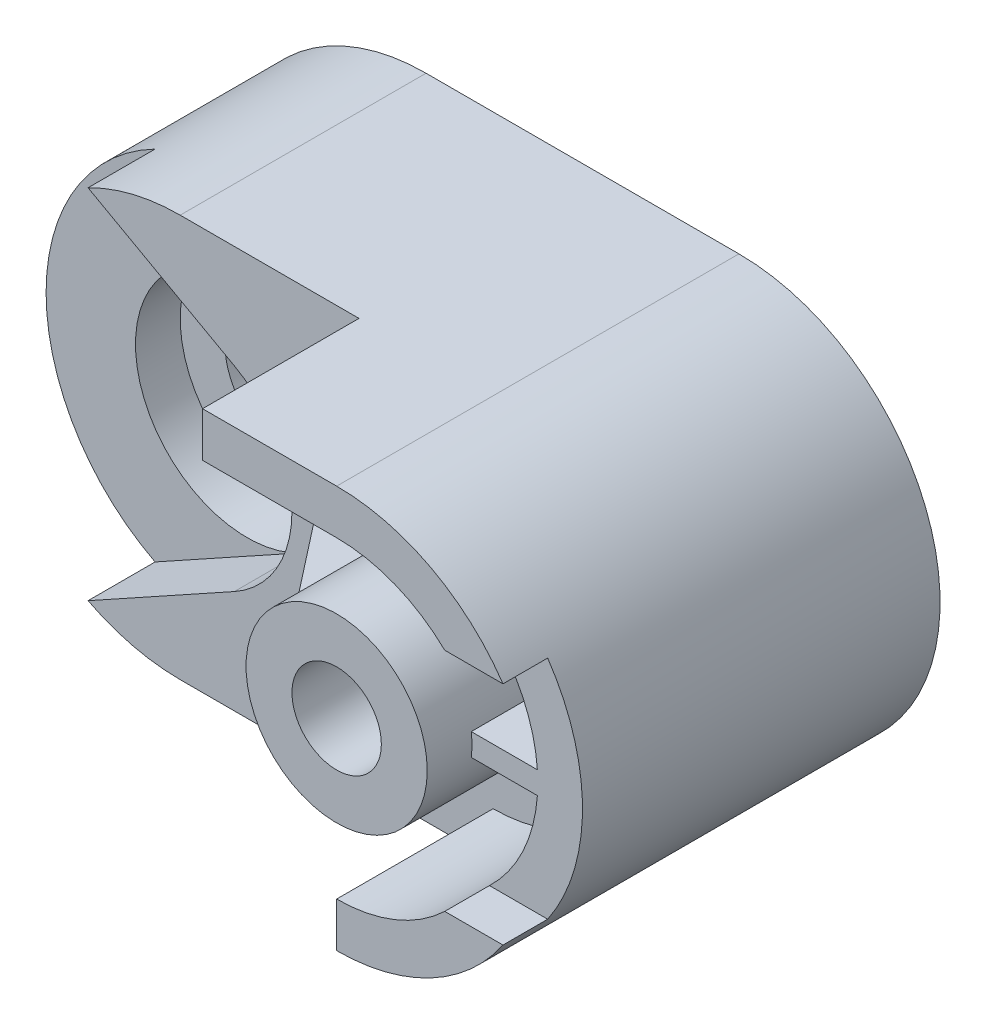
ISO-10303-21;
HEADER;
FILE_DESCRIPTION(('STEP AP214'),'2;1');
FILE_NAME('part.step','',(''),(''),'','','');
FILE_SCHEMA(('AUTOMOTIVE_DESIGN { 1 0 10303 214 1 1 1 1 }'));
ENDSEC;
DATA;
#1=APPLICATION_CONTEXT('core data for automotive mechanical design processes');
#2=APPLICATION_PROTOCOL_DEFINITION('international standard','automotive_design',2000,#1);
#3=PRODUCT_CONTEXT('',#1,'mechanical');
#4=PRODUCT('Part','Part','',(#3));
#5=PRODUCT_RELATED_PRODUCT_CATEGORY('part','',(#4));
#6=PRODUCT_DEFINITION_FORMATION('','',#4);
#7=PRODUCT_DEFINITION_CONTEXT('part definition',#1,'design');
#8=PRODUCT_DEFINITION('design','',#6,#7);
#9=PRODUCT_DEFINITION_SHAPE('','',#8);
#10=(LENGTH_UNIT() NAMED_UNIT(*) SI_UNIT(.MILLI.,.METRE.));
#11=(NAMED_UNIT(*) PLANE_ANGLE_UNIT() SI_UNIT($,.RADIAN.));
#12=(NAMED_UNIT(*) SI_UNIT($,.STERADIAN.) SOLID_ANGLE_UNIT());
#13=UNCERTAINTY_MEASURE_WITH_UNIT(LENGTH_MEASURE(1.E-05),#10,'distance_accuracy_value','');
#14=(GEOMETRIC_REPRESENTATION_CONTEXT(3) GLOBAL_UNCERTAINTY_ASSIGNED_CONTEXT((#13)) GLOBAL_UNIT_ASSIGNED_CONTEXT((#10,
#11,#12)) REPRESENTATION_CONTEXT('',''));
#15=CARTESIAN_POINT('',(0.,0.,0.));
#16=DIRECTION('',(0.,0.,1.));
#17=DIRECTION('',(1.,0.,0.));
#18=AXIS2_PLACEMENT_3D('',#15,#16,#17);
#19=CARTESIAN_POINT('',(145.,25.3,80.));
#20=DIRECTION('',(0.,0.,1.));
#21=DIRECTION('',(1.,0.,0.));
#22=AXIS2_PLACEMENT_3D('',#19,#20,#21);
#23=PLANE('',#22);
#24=CARTESIAN_POINT('',(70.,0.,80.));
#25=DIRECTION('',(0.,0.,1.));
#26=DIRECTION('',(1.,0.,0.));
#27=AXIS2_PLACEMENT_3D('',#24,#25,#26);
#28=CIRCLE('',#27,35.);
#29=CARTESIAN_POINT('',(104.910600109422,2.50000000000001,80.));
#30=VERTEX_POINT('',#29);
#31=CARTESIAN_POINT('',(94.1849126523128,25.3,80.));
#32=VERTEX_POINT('',#31);
#33=EDGE_CURVE('E417',#30,#32,#28,.T.);
#34=ORIENTED_EDGE('',*,*,#33,.F.);
#35=DIRECTION('',(1.,0.,0.));
#36=VECTOR('',#35,1.);
#37=CARTESIAN_POINT('',(0.,2.50000000000001,80.));
#38=LINE('',#37,#36);
#39=CARTESIAN_POINT('',(90.1126705203132,2.50000000000001,80.));
#40=VERTEX_POINT('',#39);
#41=EDGE_CURVE('E451',#40,#30,#38,.T.);
#42=ORIENTED_EDGE('',*,*,#41,.F.);
#43=CARTESIAN_POINT('',(70.,0.,80.));
#44=DIRECTION('',(0.,0.,1.));
#45=DIRECTION('',(1.,0.,0.));
#46=AXIS2_PLACEMENT_3D('',#43,#44,#45);
#47=CIRCLE('',#46,20.2674496535374);
#48=CARTESIAN_POINT('',(90.1126705203132,-2.49999999999999,80.));
#49=VERTEX_POINT('',#48);
#50=EDGE_CURVE('E224',#40,#49,#47,.F.);
#51=ORIENTED_EDGE('',*,*,#50,.T.);
#52=DIRECTION('',(1.,0.,0.));
#53=VECTOR('',#52,1.);
#54=CARTESIAN_POINT('',(0.,-2.49999999999999,80.));
#55=LINE('',#54,#53);
#56=CARTESIAN_POINT('',(104.910600109422,-2.49999999999999,80.));
#57=VERTEX_POINT('',#56);
#58=EDGE_CURVE('E440',#49,#57,#55,.T.);
#59=ORIENTED_EDGE('',*,*,#58,.T.);
#60=CARTESIAN_POINT('',(70.,0.,80.));
#61=DIRECTION('',(0.,0.,1.));
#62=DIRECTION('',(1.,0.,0.));
#63=AXIS2_PLACEMENT_3D('',#60,#61,#62);
#64=CIRCLE('',#63,35.);
#65=CARTESIAN_POINT('',(94.1849126523128,-25.3,80.));
#66=VERTEX_POINT('',#65);
#67=EDGE_CURVE('E420',#57,#66,#64,.F.);
#68=ORIENTED_EDGE('',*,*,#67,.T.);
#69=DIRECTION('',(-1.,0.,0.));
#70=VECTOR('',#69,1.);
#71=CARTESIAN_POINT('',(145.,-25.3,80.));
#72=LINE('',#71,#70);
#73=CARTESIAN_POINT('',(107.214378941479,-25.3,80.));
#74=VERTEX_POINT('',#73);
#75=EDGE_CURVE('E223',#74,#66,#72,.T.);
#76=ORIENTED_EDGE('',*,*,#75,.F.);
#77=CARTESIAN_POINT('',(70.,0.,80.));
#78=DIRECTION('',(0.,0.,1.));
#79=DIRECTION('',(1.,0.,0.));
#80=AXIS2_PLACEMENT_3D('',#77,#78,#79);
#81=CIRCLE('',#80,45.);
#82=CARTESIAN_POINT('',(107.214378941479,25.3,80.));
#83=VERTEX_POINT('',#82);
#84=EDGE_CURVE('E261',#74,#83,#81,.T.);
#85=ORIENTED_EDGE('',*,*,#84,.T.);
#86=DIRECTION('',(-1.,0.,0.));
#87=VECTOR('',#86,1.);
#88=CARTESIAN_POINT('',(145.,25.3,80.));
#89=LINE('',#88,#87);
#90=EDGE_CURVE('E256',#83,#32,#89,.T.);
#91=ORIENTED_EDGE('',*,*,#90,.T.);
#92=EDGE_LOOP('',(#34,#42,#51,#59,#68,#76,#85,#91));
#93=FACE_BOUND('',#92,.T.);
#94=ADVANCED_FACE('F33',(#93),#23,.T.);
#95=CARTESIAN_POINT('',(70.,0.,90.));
#96=DIRECTION('',(0.,0.,-1.));
#97=DIRECTION('',(-1.,0.,0.));
#98=AXIS2_PLACEMENT_3D('',#95,#96,#97);
#99=CYLINDRICAL_SURFACE('',#98,45.);
#100=ORIENTED_EDGE('',*,*,#84,.F.);
#101=DIRECTION('',(0.,0.,-1.));
#102=VECTOR('',#101,1.);
#103=CARTESIAN_POINT('',(107.214378941479,-25.3,90.));
#104=LINE('',#103,#102);
#105=CARTESIAN_POINT('',(107.214378941479,-25.3,90.));
#106=VERTEX_POINT('',#105);
#107=EDGE_CURVE('E252',#106,#74,#104,.T.);
#108=ORIENTED_EDGE('',*,*,#107,.F.);
#109=CARTESIAN_POINT('',(70.,0.,90.));
#110=DIRECTION('',(0.,0.,1.));
#111=DIRECTION('',(1.,0.,0.));
#112=AXIS2_PLACEMENT_3D('',#109,#110,#111);
#113=CIRCLE('',#112,45.);
#114=CARTESIAN_POINT('',(70.,-45.,90.));
#115=VERTEX_POINT('',#114);
#116=EDGE_CURVE('E385',#115,#106,#113,.T.);
#117=ORIENTED_EDGE('',*,*,#116,.F.);
#118=DIRECTION('',(0.,0.,-1.));
#119=VECTOR('',#118,1.);
#120=CARTESIAN_POINT('',(70.,-45.,90.));
#121=LINE('',#120,#119);
#122=CARTESIAN_POINT('',(70.,-45.,55.));
#123=VERTEX_POINT('',#122);
#124=EDGE_CURVE('E408',#115,#123,#121,.T.);
#125=ORIENTED_EDGE('',*,*,#124,.T.);
#126=CARTESIAN_POINT('',(70.,-45.,0.));
#127=VERTEX_POINT('',#126);
#128=EDGE_CURVE('E407',#123,#127,#121,.T.);
#129=ORIENTED_EDGE('',*,*,#128,.T.);
#130=CARTESIAN_POINT('',(70.,0.,0.));
#131=DIRECTION('',(0.,0.,1.));
#132=DIRECTION('',(1.,0.,0.));
#133=AXIS2_PLACEMENT_3D('',#130,#131,#132);
#134=CIRCLE('',#133,45.);
#135=CARTESIAN_POINT('',(70.,45.,0.));
#136=VERTEX_POINT('',#135);
#137=EDGE_CURVE('E398',#127,#136,#134,.T.);
#138=ORIENTED_EDGE('',*,*,#137,.T.);
#139=DIRECTION('',(0.,0.,-1.));
#140=VECTOR('',#139,1.);
#141=CARTESIAN_POINT('',(70.,45.,90.));
#142=LINE('',#141,#140);
#143=CARTESIAN_POINT('',(70.,45.,90.));
#144=VERTEX_POINT('',#143);
#145=EDGE_CURVE('E404',#144,#136,#142,.T.);
#146=ORIENTED_EDGE('',*,*,#145,.F.);
#147=CARTESIAN_POINT('',(107.214378941479,25.3,90.));
#148=VERTEX_POINT('',#147);
#149=EDGE_CURVE('E389',#148,#144,#113,.T.);
#150=ORIENTED_EDGE('',*,*,#149,.F.);
#151=DIRECTION('',(0.,0.,-1.));
#152=VECTOR('',#151,1.);
#153=CARTESIAN_POINT('',(107.214378941479,25.3,90.));
#154=LINE('',#153,#152);
#155=EDGE_CURVE('E259',#83,#148,#154,.F.);
#156=ORIENTED_EDGE('',*,*,#155,.F.);
#157=EDGE_LOOP('',(#100,#108,#117,#125,#129,#138,#146,#150,#156));
#158=FACE_BOUND('',#157,.T.);
#159=ADVANCED_FACE('F506',(#158),#99,.T.);
#160=CARTESIAN_POINT('',(70.,0.,55.));
#161=DIRECTION('',(0.,0.,1.));
#162=DIRECTION('',(1.,0.,0.));
#163=AXIS2_PLACEMENT_3D('',#160,#161,#162);
#164=CYLINDRICAL_SURFACE('',#163,35.);
#165=ORIENTED_EDGE('',*,*,#67,.F.);
#166=DIRECTION('',(0.,0.,1.));
#167=VECTOR('',#166,1.);
#168=CARTESIAN_POINT('',(104.910600109422,-2.49999999999999,55.));
#169=LINE('',#168,#167);
#170=CARTESIAN_POINT('',(104.910600109422,-2.49999999999999,55.));
#171=VERTEX_POINT('',#170);
#172=EDGE_CURVE('E434',#171,#57,#169,.T.);
#173=ORIENTED_EDGE('',*,*,#172,.F.);
#174=CARTESIAN_POINT('',(70.,0.,55.));
#175=DIRECTION('',(0.,0.,1.));
#176=DIRECTION('',(1.,0.,0.));
#177=AXIS2_PLACEMENT_3D('',#174,#175,#176);
#178=CIRCLE('',#177,35.);
#179=CARTESIAN_POINT('',(70.,-35.,55.));
#180=VERTEX_POINT('',#179);
#181=EDGE_CURVE('E289',#180,#171,#178,.T.);
#182=ORIENTED_EDGE('',*,*,#181,.F.);
#183=DIRECTION('',(0.,0.,1.));
#184=VECTOR('',#183,1.);
#185=CARTESIAN_POINT('',(70.,-35.,55.));
#186=LINE('',#185,#184);
#187=CARTESIAN_POINT('',(70.,-35.,90.));
#188=VERTEX_POINT('',#187);
#189=EDGE_CURVE('E309',#180,#188,#186,.T.);
#190=ORIENTED_EDGE('',*,*,#189,.T.);
#191=CARTESIAN_POINT('',(70.,0.,90.));
#192=DIRECTION('',(0.,0.,1.));
#193=DIRECTION('',(1.,0.,0.));
#194=AXIS2_PLACEMENT_3D('',#191,#192,#193);
#195=CIRCLE('',#194,35.);
#196=CARTESIAN_POINT('',(94.1849126523128,-25.3,90.));
#197=VERTEX_POINT('',#196);
#198=EDGE_CURVE('E306',#188,#197,#195,.T.);
#199=ORIENTED_EDGE('',*,*,#198,.T.);
#200=DIRECTION('',(0.,0.,1.));
#201=VECTOR('',#200,1.);
#202=CARTESIAN_POINT('',(94.1849126523128,-25.3,55.));
#203=LINE('',#202,#201);
#204=EDGE_CURVE('E422',#66,#197,#203,.T.);
#205=ORIENTED_EDGE('',*,*,#204,.F.);
#206=EDGE_LOOP('',(#165,#173,#182,#190,#199,#205));
#207=FACE_BOUND('',#206,.T.);
#208=ADVANCED_FACE('F516',(#207),#164,.F.);
#209=CARTESIAN_POINT('',(70.,0.,55.));
#210=DIRECTION('',(0.,0.,1.));
#211=DIRECTION('',(1.,0.,0.));
#212=AXIS2_PLACEMENT_3D('',#209,#210,#211);
#213=CYLINDRICAL_SURFACE('',#212,35.);
#214=CARTESIAN_POINT('',(70.,0.,55.));
#215=DIRECTION('',(0.,0.,1.));
#216=DIRECTION('',(1.,0.,0.));
#217=AXIS2_PLACEMENT_3D('',#214,#215,#216);
#218=CIRCLE('',#217,35.);
#219=CARTESIAN_POINT('',(70.,35.,55.));
#220=VERTEX_POINT('',#219);
#221=CARTESIAN_POINT('',(104.910600109422,2.50000000000001,55.));
#222=VERTEX_POINT('',#221);
#223=EDGE_CURVE('E266',#220,#222,#218,.F.);
#224=ORIENTED_EDGE('',*,*,#223,.T.);
#225=DIRECTION('',(0.,0.,1.));
#226=VECTOR('',#225,1.);
#227=CARTESIAN_POINT('',(104.910600109422,2.50000000000001,55.));
#228=LINE('',#227,#226);
#229=EDGE_CURVE('E443',#222,#30,#228,.T.);
#230=ORIENTED_EDGE('',*,*,#229,.T.);
#231=ORIENTED_EDGE('',*,*,#33,.T.);
#232=DIRECTION('',(0.,0.,1.));
#233=VECTOR('',#232,1.);
#234=CARTESIAN_POINT('',(94.1849126523128,25.3,55.));
#235=LINE('',#234,#233);
#236=CARTESIAN_POINT('',(94.1849126523128,25.3,90.));
#237=VERTEX_POINT('',#236);
#238=EDGE_CURVE('E413',#32,#237,#235,.T.);
#239=ORIENTED_EDGE('',*,*,#238,.T.);
#240=CARTESIAN_POINT('',(70.,0.,90.));
#241=DIRECTION('',(0.,0.,1.));
#242=DIRECTION('',(1.,0.,0.));
#243=AXIS2_PLACEMENT_3D('',#240,#241,#242);
#244=CIRCLE('',#243,35.);
#245=CARTESIAN_POINT('',(70.,35.,90.));
#246=VERTEX_POINT('',#245);
#247=EDGE_CURVE('E294',#246,#237,#244,.F.);
#248=ORIENTED_EDGE('',*,*,#247,.F.);
#249=DIRECTION('',(0.,0.,1.));
#250=VECTOR('',#249,1.);
#251=CARTESIAN_POINT('',(70.,35.,55.));
#252=LINE('',#251,#250);
#253=EDGE_CURVE('E291',#220,#246,#252,.T.);
#254=ORIENTED_EDGE('',*,*,#253,.F.);
#255=EDGE_LOOP('',(#224,#230,#231,#239,#248,#254));
#256=FACE_BOUND('',#255,.T.);
#257=ADVANCED_FACE('F465',(#256),#213,.F.);
#258=CARTESIAN_POINT('',(70.,0.,55.));
#259=DIRECTION('',(0.,0.,1.));
#260=DIRECTION('',(1.,0.,0.));
#261=AXIS2_PLACEMENT_3D('',#258,#259,#260);
#262=CYLINDRICAL_SURFACE('',#261,20.2674496535374);
#263=DIRECTION('',(0.,0.,1.));
#264=VECTOR('',#263,1.);
#265=CARTESIAN_POINT('',(49.8873294796869,2.5,55.));
#266=LINE('',#265,#264);
#267=CARTESIAN_POINT('',(49.8873294796869,2.5,55.));
#268=VERTEX_POINT('',#267);
#269=CARTESIAN_POINT('',(49.8873294796869,2.5,80.));
#270=VERTEX_POINT('',#269);
#271=EDGE_CURVE('E238',#268,#270,#266,.T.);
#272=ORIENTED_EDGE('',*,*,#271,.T.);
#273=CARTESIAN_POINT('',(70.,0.,80.));
#274=DIRECTION('',(0.,0.,-1.));
#275=DIRECTION('',(-1.,0.,0.));
#276=AXIS2_PLACEMENT_3D('',#273,#274,#275);
#277=CIRCLE('',#276,20.2674496535374);
#278=CARTESIAN_POINT('',(49.8873294796869,-2.5,80.));
#279=VERTEX_POINT('',#278);
#280=EDGE_CURVE('E41',#270,#279,#277,.F.);
#281=ORIENTED_EDGE('',*,*,#280,.T.);
#282=DIRECTION('',(0.,0.,1.));
#283=VECTOR('',#282,1.);
#284=CARTESIAN_POINT('',(49.8873294796869,-2.5,55.));
#285=LINE('',#284,#283);
#286=CARTESIAN_POINT('',(49.8873294796869,-2.5,55.));
#287=VERTEX_POINT('',#286);
#288=EDGE_CURVE('E232',#287,#279,#285,.T.);
#289=ORIENTED_EDGE('',*,*,#288,.F.);
#290=CARTESIAN_POINT('',(70.,0.,55.));
#291=DIRECTION('',(0.,0.,1.));
#292=DIRECTION('',(1.,0.,0.));
#293=AXIS2_PLACEMENT_3D('',#290,#291,#292);
#294=CIRCLE('',#293,20.2674496535374);
#295=CARTESIAN_POINT('',(90.1126705203132,-2.49999999999999,55.));
#296=VERTEX_POINT('',#295);
#297=EDGE_CURVE('E237',#287,#296,#294,.T.);
#298=ORIENTED_EDGE('',*,*,#297,.T.);
#299=DIRECTION('',(0.,0.,1.));
#300=VECTOR('',#299,1.);
#301=CARTESIAN_POINT('',(90.1126705203132,-2.49999999999999,55.));
#302=LINE('',#301,#300);
#303=EDGE_CURVE('E432',#296,#49,#302,.T.);
#304=ORIENTED_EDGE('',*,*,#303,.T.);
#305=ORIENTED_EDGE('',*,*,#50,.F.);
#306=DIRECTION('',(0.,0.,1.));
#307=VECTOR('',#306,1.);
#308=CARTESIAN_POINT('',(90.1126705203132,2.50000000000001,55.));
#309=LINE('',#308,#307);
#310=CARTESIAN_POINT('',(90.1126705203132,2.50000000000001,55.));
#311=VERTEX_POINT('',#310);
#312=EDGE_CURVE('E446',#311,#40,#309,.T.);
#313=ORIENTED_EDGE('',*,*,#312,.F.);
#314=EDGE_CURVE('E264',#311,#268,#294,.T.);
#315=ORIENTED_EDGE('',*,*,#314,.T.);
#316=EDGE_LOOP('',(#272,#281,#289,#298,#304,#305,#313,#315));
#317=FACE_BOUND('',#316,.T.);
#318=CARTESIAN_POINT('',(70.,0.,90.));
#319=DIRECTION('',(0.,0.,1.));
#320=DIRECTION('',(1.,0.,0.));
#321=AXIS2_PLACEMENT_3D('',#318,#319,#320);
#322=CIRCLE('',#321,20.2674496535374);
#323=CARTESIAN_POINT('',(90.2674496535374,0.,90.));
#324=VERTEX_POINT('',#323);
#325=EDGE_CURVE('E263',#324,#324,#322,.T.);
#326=ORIENTED_EDGE('',*,*,#325,.F.);
#327=EDGE_LOOP('',(#326));
#328=FACE_BOUND('',#327,.T.);
#329=ADVANCED_FACE('F425',(#317,#328),#262,.T.);
#330=CARTESIAN_POINT('',(0.,0.,55.));
#331=DIRECTION('',(0.,0.,1.));
#332=DIRECTION('',(1.,0.,0.));
#333=AXIS2_PLACEMENT_3D('',#330,#331,#332);
#334=PLANE('',#333);
#335=DIRECTION('',(0.,-1.,0.));
#336=VECTOR('',#335,1.);
#337=CARTESIAN_POINT('',(30.3589838486225,5.,55.));
#338=LINE('',#337,#336);
#339=CARTESIAN_POINT('',(30.3589838486225,2.5,55.));
#340=VERTEX_POINT('',#339);
#341=CARTESIAN_POINT('',(30.3589838486225,-2.5,55.));
#342=VERTEX_POINT('',#341);
#343=EDGE_CURVE('E215',#340,#342,#338,.T.);
#344=ORIENTED_EDGE('',*,*,#343,.F.);
#345=DIRECTION('',(1.,0.,0.));
#346=VECTOR('',#345,1.);
#347=CARTESIAN_POINT('',(0.,2.5,55.));
#348=LINE('',#347,#346);
#349=EDGE_CURVE('E242',#340,#268,#348,.T.);
#350=ORIENTED_EDGE('',*,*,#349,.T.);
#351=ORIENTED_EDGE('',*,*,#314,.F.);
#352=DIRECTION('',(1.,0.,0.));
#353=VECTOR('',#352,1.);
#354=CARTESIAN_POINT('',(0.,2.50000000000001,55.));
#355=LINE('',#354,#353);
#356=EDGE_CURVE('E448',#311,#222,#355,.T.);
#357=ORIENTED_EDGE('',*,*,#356,.T.);
#358=ORIENTED_EDGE('',*,*,#223,.F.);
#359=DIRECTION('',(1.,0.,0.));
#360=VECTOR('',#359,1.);
#361=CARTESIAN_POINT('',(0.,35.,55.));
#362=LINE('',#361,#360);
#363=CARTESIAN_POINT('',(40.,35.,55.));
#364=VERTEX_POINT('',#363);
#365=EDGE_CURVE('E268',#364,#220,#362,.T.);
#366=ORIENTED_EDGE('',*,*,#365,.F.);
#367=DIRECTION('',(0.,-1.,0.));
#368=VECTOR('',#367,1.);
#369=CARTESIAN_POINT('',(40.,0.,55.));
#370=LINE('',#369,#368);
#371=CARTESIAN_POINT('',(40.,45.,55.));
#372=VERTEX_POINT('',#371);
#373=EDGE_CURVE('E270',#372,#364,#370,.T.);
#374=ORIENTED_EDGE('',*,*,#373,.F.);
#375=DIRECTION('',(-1.,0.,0.));
#376=VECTOR('',#375,1.);
#377=CARTESIAN_POINT('',(0.,45.,55.));
#378=LINE('',#377,#376);
#379=CARTESIAN_POINT('',(0.,45.,55.));
#380=VERTEX_POINT('',#379);
#381=EDGE_CURVE('E272',#372,#380,#378,.T.);
#382=ORIENTED_EDGE('',*,*,#381,.T.);
#383=CARTESIAN_POINT('',(0.,0.,55.));
#384=DIRECTION('',(0.,0.,1.));
#385=DIRECTION('',(1.,0.,0.));
#386=AXIS2_PLACEMENT_3D('',#383,#384,#385);
#387=CIRCLE('',#386,45.);
#388=CARTESIAN_POINT('',(-20.6155281280883,40.,55.));
#389=VERTEX_POINT('',#388);
#390=EDGE_CURVE('E274',#380,#389,#387,.T.);
#391=ORIENTED_EDGE('',*,*,#390,.T.);
#392=DIRECTION('',(0.874746879519543,-0.48458012420117,0.));
#393=VECTOR('',#392,1.);
#394=CARTESIAN_POINT('',(12.1145031050292,21.8686719879886,55.));
#395=LINE('',#394,#393);
#396=CARTESIAN_POINT('',(12.1145031050293,21.8686719879886,55.));
#397=VERTEX_POINT('',#396);
#398=EDGE_CURVE('E56',#389,#397,#395,.T.);
#399=ORIENTED_EDGE('',*,*,#398,.T.);
#400=CARTESIAN_POINT('',(0.,0.,55.));
#401=DIRECTION('',(0.,0.,1.));
#402=DIRECTION('',(1.,0.,0.));
#403=AXIS2_PLACEMENT_3D('',#400,#401,#402);
#404=CIRCLE('',#403,25.);
#405=CARTESIAN_POINT('',(12.1145031050293,-21.8686719879886,55.));
#406=VERTEX_POINT('',#405);
#407=EDGE_CURVE('E277',#397,#406,#404,.F.);
#408=ORIENTED_EDGE('',*,*,#407,.T.);
#409=DIRECTION('',(-0.874746879519543,-0.48458012420117,0.));
#410=VECTOR('',#409,1.);
#411=CARTESIAN_POINT('',(12.1145031050292,-21.8686719879886,55.));
#412=LINE('',#411,#410);
#413=CARTESIAN_POINT('',(-20.6155281280883,-40.,55.));
#414=VERTEX_POINT('',#413);
#415=EDGE_CURVE('E279',#406,#414,#412,.T.);
#416=ORIENTED_EDGE('',*,*,#415,.T.);
#417=CARTESIAN_POINT('',(0.,0.,55.));
#418=DIRECTION('',(0.,0.,1.));
#419=DIRECTION('',(1.,0.,0.));
#420=AXIS2_PLACEMENT_3D('',#417,#418,#419);
#421=CIRCLE('',#420,45.);
#422=CARTESIAN_POINT('',(0.,-45.,55.));
#423=VERTEX_POINT('',#422);
#424=EDGE_CURVE('E281',#414,#423,#421,.T.);
#425=ORIENTED_EDGE('',*,*,#424,.T.);
#426=DIRECTION('',(1.,0.,0.));
#427=VECTOR('',#426,1.);
#428=CARTESIAN_POINT('',(0.,-45.,55.));
#429=LINE('',#428,#427);
#430=EDGE_CURVE('E283',#423,#123,#429,.T.);
#431=ORIENTED_EDGE('',*,*,#430,.T.);
#432=DIRECTION('',(0.,1.,0.));
#433=VECTOR('',#432,1.);
#434=CARTESIAN_POINT('',(70.,0.,55.));
#435=LINE('',#434,#433);
#436=EDGE_CURVE('E286',#123,#180,#435,.T.);
#437=ORIENTED_EDGE('',*,*,#436,.T.);
#438=ORIENTED_EDGE('',*,*,#181,.T.);
#439=DIRECTION('',(1.,0.,0.));
#440=VECTOR('',#439,1.);
#441=CARTESIAN_POINT('',(0.,-2.49999999999999,55.));
#442=LINE('',#441,#440);
#443=EDGE_CURVE('E438',#296,#171,#442,.T.);
#444=ORIENTED_EDGE('',*,*,#443,.F.);
#445=ORIENTED_EDGE('',*,*,#297,.F.);
#446=DIRECTION('',(1.,0.,0.));
#447=VECTOR('',#446,1.);
#448=CARTESIAN_POINT('',(0.,-2.5,55.));
#449=LINE('',#448,#447);
#450=EDGE_CURVE('E230',#342,#287,#449,.T.);
#451=ORIENTED_EDGE('',*,*,#450,.F.);
#452=EDGE_LOOP('',(#344,#350,#351,#357,#358,#366,#374,#382,#391,#399,#408,#416,#425,#431,#437,
#438,#444,#445,#451));
#453=FACE_BOUND('',#452,.T.);
#454=ADVANCED_FACE('F235',(#453),#334,.T.);
#455=CARTESIAN_POINT('',(0.,0.,90.));
#456=DIRECTION('',(0.,0.,1.));
#457=DIRECTION('',(1.,0.,0.));
#458=AXIS2_PLACEMENT_3D('',#455,#456,#457);
#459=PLANE('',#458);
#460=ORIENTED_EDGE('',*,*,#116,.T.);
#461=DIRECTION('',(-1.,0.,0.));
#462=VECTOR('',#461,1.);
#463=CARTESIAN_POINT('',(145.,-25.3,90.));
#464=LINE('',#463,#462);
#465=EDGE_CURVE('E249',#106,#197,#464,.T.);
#466=ORIENTED_EDGE('',*,*,#465,.T.);
#467=ORIENTED_EDGE('',*,*,#198,.F.);
#468=DIRECTION('',(0.,1.,0.));
#469=VECTOR('',#468,1.);
#470=CARTESIAN_POINT('',(70.,0.,90.));
#471=LINE('',#470,#469);
#472=EDGE_CURVE('E303',#115,#188,#471,.T.);
#473=ORIENTED_EDGE('',*,*,#472,.F.);
#474=EDGE_LOOP('',(#460,#466,#467,#473));
#475=FACE_BOUND('',#474,.T.);
#476=ADVANCED_FACE('F513',(#475),#459,.T.);
#477=ORIENTED_EDGE('',*,*,#325,.T.);
#478=EDGE_LOOP('',(#477));
#479=FACE_BOUND('',#478,.T.);
#480=CARTESIAN_POINT('',(70.,0.,90.));
#481=DIRECTION('',(0.,0.,1.));
#482=DIRECTION('',(1.,0.,0.));
#483=AXIS2_PLACEMENT_3D('',#480,#481,#482);
#484=CIRCLE('',#483,9.99999999999999);
#485=CARTESIAN_POINT('',(80.,0.,90.));
#486=VERTEX_POINT('',#485);
#487=EDGE_CURVE('E340',#486,#486,#484,.T.);
#488=ORIENTED_EDGE('',*,*,#487,.F.);
#489=EDGE_LOOP('',(#488));
#490=FACE_BOUND('',#489,.T.);
#491=ADVANCED_FACE('F610',(#479,#490),#459,.T.);
#492=ORIENTED_EDGE('',*,*,#247,.T.);
#493=DIRECTION('',(-1.,0.,0.));
#494=VECTOR('',#493,1.);
#495=CARTESIAN_POINT('',(145.,25.3,90.));
#496=LINE('',#495,#494);
#497=EDGE_CURVE('E48',#148,#237,#496,.T.);
#498=ORIENTED_EDGE('',*,*,#497,.F.);
#499=ORIENTED_EDGE('',*,*,#149,.T.);
#500=DIRECTION('',(-1.,0.,0.));
#501=VECTOR('',#500,1.);
#502=CARTESIAN_POINT('',(0.,45.,90.));
#503=LINE('',#502,#501);
#504=CARTESIAN_POINT('',(40.,45.,90.));
#505=VERTEX_POINT('',#504);
#506=EDGE_CURVE('E388',#144,#505,#503,.T.);
#507=ORIENTED_EDGE('',*,*,#506,.T.);
#508=DIRECTION('',(0.,-1.,0.));
#509=VECTOR('',#508,1.);
#510=CARTESIAN_POINT('',(40.,0.,90.));
#511=LINE('',#510,#509);
#512=CARTESIAN_POINT('',(40.,35.,90.));
#513=VERTEX_POINT('',#512);
#514=EDGE_CURVE('E300',#505,#513,#511,.T.);
#515=ORIENTED_EDGE('',*,*,#514,.T.);
#516=DIRECTION('',(1.,0.,0.));
#517=VECTOR('',#516,1.);
#518=CARTESIAN_POINT('',(0.,35.,90.));
#519=LINE('',#518,#517);
#520=EDGE_CURVE('E297',#513,#246,#519,.T.);
#521=ORIENTED_EDGE('',*,*,#520,.T.);
#522=EDGE_LOOP('',(#492,#498,#499,#507,#515,#521));
#523=FACE_BOUND('',#522,.T.);
#524=ADVANCED_FACE('F532',(#523),#459,.T.);
#525=CARTESIAN_POINT('',(0.,0.,90.));
#526=DIRECTION('',(0.,0.,-1.));
#527=DIRECTION('',(-1.,0.,0.));
#528=AXIS2_PLACEMENT_3D('',#525,#526,#527);
#529=CYLINDRICAL_SURFACE('',#528,45.);
#530=ORIENTED_EDGE('',*,*,#390,.F.);
#531=DIRECTION('',(0.,0.,-1.));
#532=VECTOR('',#531,1.);
#533=CARTESIAN_POINT('',(0.,45.,90.));
#534=LINE('',#533,#532);
#535=CARTESIAN_POINT('',(0.,45.,0.));
#536=VERTEX_POINT('',#535);
#537=EDGE_CURVE('E392',#380,#536,#534,.T.);
#538=ORIENTED_EDGE('',*,*,#537,.T.);
#539=CARTESIAN_POINT('',(0.,0.,0.));
#540=DIRECTION('',(0.,0.,1.));
#541=DIRECTION('',(1.,0.,0.));
#542=AXIS2_PLACEMENT_3D('',#539,#540,#541);
#543=CIRCLE('',#542,45.);
#544=CARTESIAN_POINT('',(0.,-45.,0.));
#545=VERTEX_POINT('',#544);
#546=EDGE_CURVE('E378',#536,#545,#543,.T.);
#547=ORIENTED_EDGE('',*,*,#546,.T.);
#548=DIRECTION('',(0.,0.,-1.));
#549=VECTOR('',#548,1.);
#550=CARTESIAN_POINT('',(0.,-45.,90.));
#551=LINE('',#550,#549);
#552=EDGE_CURVE('E411',#423,#545,#551,.T.);
#553=ORIENTED_EDGE('',*,*,#552,.F.);
#554=ORIENTED_EDGE('',*,*,#424,.F.);
#555=DIRECTION('',(0.,0.,1.));
#556=VECTOR('',#555,1.);
#557=CARTESIAN_POINT('',(-20.6155281280883,-40.,40.));
#558=LINE('',#557,#556);
#559=CARTESIAN_POINT('',(-20.6155281280883,-40.,40.));
#560=VERTEX_POINT('',#559);
#561=EDGE_CURVE('E337',#560,#414,#558,.T.);
#562=ORIENTED_EDGE('',*,*,#561,.F.);
#563=CARTESIAN_POINT('',(0.,0.,40.));
#564=DIRECTION('',(0.,0.,1.));
#565=DIRECTION('',(1.,0.,0.));
#566=AXIS2_PLACEMENT_3D('',#563,#564,#565);
#567=CIRCLE('',#566,45.);
#568=CARTESIAN_POINT('',(-20.6155281280883,40.,40.));
#569=VERTEX_POINT('',#568);
#570=EDGE_CURVE('E333',#569,#560,#567,.T.);
#571=ORIENTED_EDGE('',*,*,#570,.F.);
#572=DIRECTION('',(0.,0.,1.));
#573=VECTOR('',#572,1.);
#574=CARTESIAN_POINT('',(-20.6155281280883,40.,40.));
#575=LINE('',#574,#573);
#576=EDGE_CURVE('E341',#569,#389,#575,.T.);
#577=ORIENTED_EDGE('',*,*,#576,.T.);
#578=EDGE_LOOP('',(#530,#538,#547,#553,#554,#562,#571,#577));
#579=FACE_BOUND('',#578,.T.);
#580=ADVANCED_FACE('F35',(#579),#529,.T.);
#581=CARTESIAN_POINT('',(0.,-45.,90.));
#582=DIRECTION('',(0.,1.,0.));
#583=DIRECTION('',(0.,0.,1.));
#584=AXIS2_PLACEMENT_3D('',#581,#582,#583);
#585=PLANE('',#584);
#586=ORIENTED_EDGE('',*,*,#430,.F.);
#587=ORIENTED_EDGE('',*,*,#552,.T.);
#588=DIRECTION('',(1.,0.,0.));
#589=VECTOR('',#588,1.);
#590=CARTESIAN_POINT('',(0.,-45.,0.));
#591=LINE('',#590,#589);
#592=EDGE_CURVE('E395',#545,#127,#591,.T.);
#593=ORIENTED_EDGE('',*,*,#592,.T.);
#594=ORIENTED_EDGE('',*,*,#128,.F.);
#595=EDGE_LOOP('',(#586,#587,#593,#594));
#596=FACE_BOUND('',#595,.T.);
#597=ADVANCED_FACE('F501',(#596),#585,.F.);
#598=CARTESIAN_POINT('',(0.,45.,90.));
#599=DIRECTION('',(0.,-1.,0.));
#600=DIRECTION('',(0.,0.,-1.));
#601=AXIS2_PLACEMENT_3D('',#598,#599,#600);
#602=PLANE('',#601);
#603=DIRECTION('',(0.,0.,1.));
#604=VECTOR('',#603,1.);
#605=CARTESIAN_POINT('',(40.,45.,55.));
#606=LINE('',#605,#604);
#607=EDGE_CURVE('E312',#372,#505,#606,.T.);
#608=ORIENTED_EDGE('',*,*,#607,.T.);
#609=ORIENTED_EDGE('',*,*,#506,.F.);
#610=ORIENTED_EDGE('',*,*,#145,.T.);
#611=DIRECTION('',(-1.,0.,0.));
#612=VECTOR('',#611,1.);
#613=CARTESIAN_POINT('',(0.,45.,0.));
#614=LINE('',#613,#612);
#615=EDGE_CURVE('E400',#136,#536,#614,.T.);
#616=ORIENTED_EDGE('',*,*,#615,.T.);
#617=ORIENTED_EDGE('',*,*,#537,.F.);
#618=ORIENTED_EDGE('',*,*,#381,.F.);
#619=EDGE_LOOP('',(#608,#609,#610,#616,#617,#618));
#620=FACE_BOUND('',#619,.T.);
#621=ADVANCED_FACE('F478',(#620),#602,.F.);
#622=CARTESIAN_POINT('',(12.1145031050292,-21.8686719879886,40.));
#623=DIRECTION('',(-0.48458012420117,0.874746879519543,0.));
#624=DIRECTION('',(-0.874746879519543,-0.48458012420117,0.));
#625=AXIS2_PLACEMENT_3D('',#622,#623,#624);
#626=PLANE('',#625);
#627=ORIENTED_EDGE('',*,*,#561,.T.);
#628=ORIENTED_EDGE('',*,*,#415,.F.);
#629=DIRECTION('',(0.,0.,1.));
#630=VECTOR('',#629,1.);
#631=CARTESIAN_POINT('',(12.1145031050293,-21.8686719879886,40.));
#632=LINE('',#631,#630);
#633=CARTESIAN_POINT('',(12.1145031050293,-21.8686719879886,40.));
#634=VERTEX_POINT('',#633);
#635=EDGE_CURVE('E336',#634,#406,#632,.T.);
#636=ORIENTED_EDGE('',*,*,#635,.F.);
#637=DIRECTION('',(-0.874746879519543,-0.48458012420117,0.));
#638=VECTOR('',#637,1.);
#639=CARTESIAN_POINT('',(12.1145031050292,-21.8686719879886,40.));
#640=LINE('',#639,#638);
#641=EDGE_CURVE('E327',#634,#560,#640,.T.);
#642=ORIENTED_EDGE('',*,*,#641,.T.);
#643=EDGE_LOOP('',(#627,#628,#636,#642));
#644=FACE_BOUND('',#643,.T.);
#645=ADVANCED_FACE('F495',(#644),#626,.T.);
#646=CARTESIAN_POINT('',(12.1145031050292,21.8686719879886,40.));
#647=DIRECTION('',(0.48458012420117,0.874746879519543,0.));
#648=DIRECTION('',(-0.874746879519543,0.48458012420117,0.));
#649=AXIS2_PLACEMENT_3D('',#646,#647,#648);
#650=PLANE('',#649);
#651=ORIENTED_EDGE('',*,*,#398,.F.);
#652=ORIENTED_EDGE('',*,*,#576,.F.);
#653=DIRECTION('',(-0.874746879519543,0.48458012420117,0.));
#654=VECTOR('',#653,1.);
#655=CARTESIAN_POINT('',(12.1145031050292,21.8686719879886,40.));
#656=LINE('',#655,#654);
#657=CARTESIAN_POINT('',(12.1145031050293,21.8686719879886,40.));
#658=VERTEX_POINT('',#657);
#659=EDGE_CURVE('E330',#658,#569,#656,.T.);
#660=ORIENTED_EDGE('',*,*,#659,.F.);
#661=DIRECTION('',(0.,0.,1.));
#662=VECTOR('',#661,1.);
#663=CARTESIAN_POINT('',(12.1145031050293,21.8686719879886,40.));
#664=LINE('',#663,#662);
#665=EDGE_CURVE('E344',#658,#397,#664,.T.);
#666=ORIENTED_EDGE('',*,*,#665,.T.);
#667=EDGE_LOOP('',(#651,#652,#660,#666));
#668=FACE_BOUND('',#667,.T.);
#669=ADVANCED_FACE('F486',(#668),#650,.F.);
#670=CARTESIAN_POINT('',(0.,0.,40.));
#671=DIRECTION('',(0.,0.,1.));
#672=DIRECTION('',(1.,0.,0.));
#673=AXIS2_PLACEMENT_3D('',#670,#671,#672);
#674=CYLINDRICAL_SURFACE('',#673,25.);
#675=CARTESIAN_POINT('',(0.,0.,30.));
#676=DIRECTION('',(0.,0.,1.));
#677=DIRECTION('',(1.,0.,0.));
#678=AXIS2_PLACEMENT_3D('',#675,#676,#677);
#679=CIRCLE('',#678,25.);
#680=CARTESIAN_POINT('',(25.,0.,30.));
#681=VERTEX_POINT('',#680);
#682=EDGE_CURVE('E324',#681,#681,#679,.T.);
#683=ORIENTED_EDGE('',*,*,#682,.F.);
#684=EDGE_LOOP('',(#683));
#685=FACE_BOUND('',#684,.T.);
#686=ORIENTED_EDGE('',*,*,#407,.F.);
#687=ORIENTED_EDGE('',*,*,#665,.F.);
#688=CARTESIAN_POINT('',(0.,0.,40.));
#689=DIRECTION('',(0.,0.,1.));
#690=DIRECTION('',(1.,0.,0.));
#691=AXIS2_PLACEMENT_3D('',#688,#689,#690);
#692=CIRCLE('',#691,25.);
#693=EDGE_CURVE('E323',#658,#634,#692,.T.);
#694=ORIENTED_EDGE('',*,*,#693,.T.);
#695=ORIENTED_EDGE('',*,*,#635,.T.);
#696=EDGE_LOOP('',(#686,#687,#694,#695));
#697=FACE_BOUND('',#696,.T.);
#698=ADVANCED_FACE('F490',(#685,#697),#674,.F.);
#699=CARTESIAN_POINT('',(0.,0.,0.));
#700=DIRECTION('',(0.,0.,1.));
#701=DIRECTION('',(1.,0.,0.));
#702=AXIS2_PLACEMENT_3D('',#699,#700,#701);
#703=PLANE('',#702);
#704=DIRECTION('',(1.,0.,0.));
#705=VECTOR('',#704,1.);
#706=CARTESIAN_POINT('',(0.,25.,0.));
#707=LINE('',#706,#705);
#708=CARTESIAN_POINT('',(0.,25.,0.));
#709=VERTEX_POINT('',#708);
#710=CARTESIAN_POINT('',(70.,25.,0.));
#711=VERTEX_POINT('',#710);
#712=EDGE_CURVE('E368',#709,#711,#707,.T.);
#713=ORIENTED_EDGE('',*,*,#712,.F.);
#714=CARTESIAN_POINT('',(0.,0.,0.));
#715=DIRECTION('',(0.,0.,-1.));
#716=DIRECTION('',(-1.,0.,0.));
#717=AXIS2_PLACEMENT_3D('',#714,#715,#716);
#718=CIRCLE('',#717,25.);
#719=CARTESIAN_POINT('',(0.,-25.,0.));
#720=VERTEX_POINT('',#719);
#721=EDGE_CURVE('E366',#720,#709,#718,.T.);
#722=ORIENTED_EDGE('',*,*,#721,.F.);
#723=DIRECTION('',(-1.,0.,0.));
#724=VECTOR('',#723,1.);
#725=CARTESIAN_POINT('',(0.,-25.,0.));
#726=LINE('',#725,#724);
#727=CARTESIAN_POINT('',(70.,-25.,0.));
#728=VERTEX_POINT('',#727);
#729=EDGE_CURVE('E356',#728,#720,#726,.T.);
#730=ORIENTED_EDGE('',*,*,#729,.F.);
#731=CARTESIAN_POINT('',(70.,0.,0.));
#732=DIRECTION('',(0.,0.,-1.));
#733=DIRECTION('',(-1.,0.,0.));
#734=AXIS2_PLACEMENT_3D('',#731,#732,#733);
#735=CIRCLE('',#734,25.);
#736=EDGE_CURVE('E371',#711,#728,#735,.T.);
#737=ORIENTED_EDGE('',*,*,#736,.F.);
#738=EDGE_LOOP('',(#713,#722,#730,#737));
#739=FACE_BOUND('',#738,.T.);
#740=ORIENTED_EDGE('',*,*,#546,.F.);
#741=ORIENTED_EDGE('',*,*,#615,.F.);
#742=ORIENTED_EDGE('',*,*,#137,.F.);
#743=ORIENTED_EDGE('',*,*,#592,.F.);
#744=EDGE_LOOP('',(#740,#741,#742,#743));
#745=FACE_BOUND('',#744,.T.);
#746=ADVANCED_FACE('F581',(#739,#745),#703,.F.);
#747=CARTESIAN_POINT('',(0.,0.,10.));
#748=DIRECTION('',(0.,0.,-1.));
#749=DIRECTION('',(-1.,0.,0.));
#750=AXIS2_PLACEMENT_3D('',#747,#748,#749);
#751=CYLINDRICAL_SURFACE('',#750,25.);
#752=ORIENTED_EDGE('',*,*,#721,.T.);
#753=DIRECTION('',(0.,0.,-1.));
#754=VECTOR('',#753,1.);
#755=CARTESIAN_POINT('',(0.,25.,10.));
#756=LINE('',#755,#754);
#757=CARTESIAN_POINT('',(0.,25.,10.));
#758=VERTEX_POINT('',#757);
#759=EDGE_CURVE('E365',#758,#709,#756,.T.);
#760=ORIENTED_EDGE('',*,*,#759,.F.);
#761=CARTESIAN_POINT('',(0.,0.,10.));
#762=DIRECTION('',(0.,0.,-1.));
#763=DIRECTION('',(-1.,0.,0.));
#764=AXIS2_PLACEMENT_3D('',#761,#762,#763);
#765=CIRCLE('',#764,25.);
#766=CARTESIAN_POINT('',(0.,-25.,10.));
#767=VERTEX_POINT('',#766);
#768=EDGE_CURVE('E352',#767,#758,#765,.T.);
#769=ORIENTED_EDGE('',*,*,#768,.F.);
#770=DIRECTION('',(0.,0.,-1.));
#771=VECTOR('',#770,1.);
#772=CARTESIAN_POINT('',(0.,-25.,10.));
#773=LINE('',#772,#771);
#774=EDGE_CURVE('E376',#767,#720,#773,.T.);
#775=ORIENTED_EDGE('',*,*,#774,.T.);
#776=EDGE_LOOP('',(#752,#760,#769,#775));
#777=FACE_BOUND('',#776,.T.);
#778=ADVANCED_FACE('F597',(#777),#751,.F.);
#779=CARTESIAN_POINT('',(0.,-25.,10.));
#780=DIRECTION('',(0.,-1.,0.));
#781=DIRECTION('',(1.,0.,0.));
#782=AXIS2_PLACEMENT_3D('',#779,#780,#781);
#783=PLANE('',#782);
#784=ORIENTED_EDGE('',*,*,#729,.T.);
#785=ORIENTED_EDGE('',*,*,#774,.F.);
#786=DIRECTION('',(-1.,0.,0.));
#787=VECTOR('',#786,1.);
#788=CARTESIAN_POINT('',(0.,-25.,10.));
#789=LINE('',#788,#787);
#790=CARTESIAN_POINT('',(70.,-25.,10.));
#791=VERTEX_POINT('',#790);
#792=EDGE_CURVE('E362',#791,#767,#789,.T.);
#793=ORIENTED_EDGE('',*,*,#792,.F.);
#794=DIRECTION('',(0.,0.,-1.));
#795=VECTOR('',#794,1.);
#796=CARTESIAN_POINT('',(70.,-25.,10.));
#797=LINE('',#796,#795);
#798=EDGE_CURVE('E379',#791,#728,#797,.T.);
#799=ORIENTED_EDGE('',*,*,#798,.T.);
#800=EDGE_LOOP('',(#784,#785,#793,#799));
#801=FACE_BOUND('',#800,.T.);
#802=ADVANCED_FACE('F593',(#801),#783,.F.);
#803=CARTESIAN_POINT('',(70.,0.,10.));
#804=DIRECTION('',(0.,0.,-1.));
#805=DIRECTION('',(-1.,0.,0.));
#806=AXIS2_PLACEMENT_3D('',#803,#804,#805);
#807=CYLINDRICAL_SURFACE('',#806,25.);
#808=ORIENTED_EDGE('',*,*,#736,.T.);
#809=ORIENTED_EDGE('',*,*,#798,.F.);
#810=CARTESIAN_POINT('',(70.,0.,10.));
#811=DIRECTION('',(0.,0.,-1.));
#812=DIRECTION('',(-1.,0.,0.));
#813=AXIS2_PLACEMENT_3D('',#810,#811,#812);
#814=CIRCLE('',#813,25.);
#815=CARTESIAN_POINT('',(70.,25.,10.));
#816=VERTEX_POINT('',#815);
#817=EDGE_CURVE('E359',#816,#791,#814,.T.);
#818=ORIENTED_EDGE('',*,*,#817,.F.);
#819=DIRECTION('',(0.,0.,-1.));
#820=VECTOR('',#819,1.);
#821=CARTESIAN_POINT('',(70.,25.,10.));
#822=LINE('',#821,#820);
#823=EDGE_CURVE('E381',#816,#711,#822,.T.);
#824=ORIENTED_EDGE('',*,*,#823,.T.);
#825=EDGE_LOOP('',(#808,#809,#818,#824));
#826=FACE_BOUND('',#825,.T.);
#827=ADVANCED_FACE('F596',(#826),#807,.F.);
#828=CARTESIAN_POINT('',(0.,25.,10.));
#829=DIRECTION('',(0.,1.,0.));
#830=DIRECTION('',(-1.,0.,0.));
#831=AXIS2_PLACEMENT_3D('',#828,#829,#830);
#832=PLANE('',#831);
#833=ORIENTED_EDGE('',*,*,#712,.T.);
#834=ORIENTED_EDGE('',*,*,#823,.F.);
#835=DIRECTION('',(1.,0.,0.));
#836=VECTOR('',#835,1.);
#837=CARTESIAN_POINT('',(0.,25.,10.));
#838=LINE('',#837,#836);
#839=EDGE_CURVE('E355',#758,#816,#838,.T.);
#840=ORIENTED_EDGE('',*,*,#839,.F.);
#841=ORIENTED_EDGE('',*,*,#759,.T.);
#842=EDGE_LOOP('',(#833,#834,#840,#841));
#843=FACE_BOUND('',#842,.T.);
#844=ADVANCED_FACE('F591',(#843),#832,.F.);
#845=CARTESIAN_POINT('',(0.,0.,10.));
#846=DIRECTION('',(0.,0.,-1.));
#847=DIRECTION('',(-1.,0.,0.));
#848=AXIS2_PLACEMENT_3D('',#845,#846,#847);
#849=PLANE('',#848);
#850=CARTESIAN_POINT('',(0.,0.,10.));
#851=DIRECTION('',(0.,0.,-1.));
#852=DIRECTION('',(-1.,0.,0.));
#853=AXIS2_PLACEMENT_3D('',#850,#851,#852);
#854=CIRCLE('',#853,15.);
#855=CARTESIAN_POINT('',(-15.,0.,10.));
#856=VERTEX_POINT('',#855);
#857=EDGE_CURVE('E320',#856,#856,#854,.T.);
#858=ORIENTED_EDGE('',*,*,#857,.F.);
#859=EDGE_LOOP('',(#858));
#860=FACE_BOUND('',#859,.T.);
#861=CARTESIAN_POINT('',(70.,0.,9.99999999999999));
#862=DIRECTION('',(0.,0.,-1.));
#863=DIRECTION('',(-1.,0.,0.));
#864=AXIS2_PLACEMENT_3D('',#861,#862,#863);
#865=CIRCLE('',#864,9.99999999999999);
#866=CARTESIAN_POINT('',(60.,0.,9.99999999999999));
#867=VERTEX_POINT('',#866);
#868=EDGE_CURVE('E351',#867,#867,#865,.T.);
#869=ORIENTED_EDGE('',*,*,#868,.F.);
#870=EDGE_LOOP('',(#869));
#871=FACE_BOUND('',#870,.T.);
#872=ORIENTED_EDGE('',*,*,#768,.T.);
#873=ORIENTED_EDGE('',*,*,#839,.T.);
#874=ORIENTED_EDGE('',*,*,#817,.T.);
#875=ORIENTED_EDGE('',*,*,#792,.T.);
#876=EDGE_LOOP('',(#872,#873,#874,#875));
#877=FACE_BOUND('',#876,.T.);
#878=ADVANCED_FACE('F587',(#860,#871,#877),#849,.T.);
#879=CARTESIAN_POINT('',(70.,0.,-76.));
#880=DIRECTION('',(0.,0.,1.));
#881=DIRECTION('',(1.,0.,0.));
#882=AXIS2_PLACEMENT_3D('',#879,#880,#881);
#883=CYLINDRICAL_SURFACE('',#882,9.99999999999999);
#884=ORIENTED_EDGE('',*,*,#868,.T.);
#885=EDGE_LOOP('',(#884));
#886=FACE_BOUND('',#885,.T.);
#887=ORIENTED_EDGE('',*,*,#487,.T.);
#888=EDGE_LOOP('',(#887));
#889=FACE_BOUND('',#888,.T.);
#890=ADVANCED_FACE('F575',(#886,#889),#883,.F.);
#891=CARTESIAN_POINT('',(0.,0.,40.));
#892=DIRECTION('',(0.,0.,1.));
#893=DIRECTION('',(1.,0.,0.));
#894=AXIS2_PLACEMENT_3D('',#891,#892,#893);
#895=PLANE('',#894);
#896=ORIENTED_EDGE('',*,*,#693,.F.);
#897=ORIENTED_EDGE('',*,*,#659,.T.);
#898=ORIENTED_EDGE('',*,*,#570,.T.);
#899=ORIENTED_EDGE('',*,*,#641,.F.);
#900=EDGE_LOOP('',(#896,#897,#898,#899));
#901=FACE_BOUND('',#900,.T.);
#902=ADVANCED_FACE('F571',(#901),#895,.T.);
#903=CARTESIAN_POINT('',(0.,0.,30.));
#904=DIRECTION('',(0.,0.,1.));
#905=DIRECTION('',(1.,0.,0.));
#906=AXIS2_PLACEMENT_3D('',#903,#904,#905);
#907=PLANE('',#906);
#908=CARTESIAN_POINT('',(0.,0.,30.));
#909=DIRECTION('',(0.,0.,1.));
#910=DIRECTION('',(1.,0.,0.));
#911=AXIS2_PLACEMENT_3D('',#908,#909,#910);
#912=CIRCLE('',#911,15.);
#913=CARTESIAN_POINT('',(15.,0.,30.));
#914=VERTEX_POINT('',#913);
#915=EDGE_CURVE('E311',#914,#914,#912,.T.);
#916=ORIENTED_EDGE('',*,*,#915,.F.);
#917=EDGE_LOOP('',(#916));
#918=FACE_BOUND('',#917,.T.);
#919=ORIENTED_EDGE('',*,*,#682,.T.);
#920=EDGE_LOOP('',(#919));
#921=FACE_BOUND('',#920,.T.);
#922=ADVANCED_FACE('F567',(#918,#921),#907,.T.);
#923=CARTESIAN_POINT('',(0.,0.,-118.));
#924=DIRECTION('',(0.,0.,1.));
#925=DIRECTION('',(1.,0.,0.));
#926=AXIS2_PLACEMENT_3D('',#923,#924,#925);
#927=CYLINDRICAL_SURFACE('',#926,15.);
#928=ORIENTED_EDGE('',*,*,#857,.T.);
#929=EDGE_LOOP('',(#928));
#930=FACE_BOUND('',#929,.T.);
#931=ORIENTED_EDGE('',*,*,#915,.T.);
#932=EDGE_LOOP('',(#931));
#933=FACE_BOUND('',#932,.T.);
#934=ADVANCED_FACE('F541',(#930,#933),#927,.F.);
#935=CARTESIAN_POINT('',(70.,0.,55.));
#936=DIRECTION('',(1.,0.,0.));
#937=DIRECTION('',(0.,0.,-1.));
#938=AXIS2_PLACEMENT_3D('',#935,#936,#937);
#939=PLANE('',#938);
#940=ORIENTED_EDGE('',*,*,#472,.T.);
#941=ORIENTED_EDGE('',*,*,#189,.F.);
#942=ORIENTED_EDGE('',*,*,#436,.F.);
#943=ORIENTED_EDGE('',*,*,#124,.F.);
#944=EDGE_LOOP('',(#940,#941,#942,#943));
#945=FACE_BOUND('',#944,.T.);
#946=ADVANCED_FACE('F510',(#945),#939,.F.);
#947=CARTESIAN_POINT('',(40.,0.,55.));
#948=DIRECTION('',(-1.,0.,0.));
#949=DIRECTION('',(0.,0.,1.));
#950=AXIS2_PLACEMENT_3D('',#947,#948,#949);
#951=PLANE('',#950);
#952=ORIENTED_EDGE('',*,*,#514,.F.);
#953=ORIENTED_EDGE('',*,*,#607,.F.);
#954=ORIENTED_EDGE('',*,*,#373,.T.);
#955=DIRECTION('',(0.,0.,1.));
#956=VECTOR('',#955,1.);
#957=CARTESIAN_POINT('',(40.,35.,55.));
#958=LINE('',#957,#956);
#959=EDGE_CURVE('E315',#364,#513,#958,.T.);
#960=ORIENTED_EDGE('',*,*,#959,.T.);
#961=EDGE_LOOP('',(#952,#953,#954,#960));
#962=FACE_BOUND('',#961,.T.);
#963=ADVANCED_FACE('F533',(#962),#951,.T.);
#964=CARTESIAN_POINT('',(0.,35.,55.));
#965=DIRECTION('',(0.,-1.,0.));
#966=DIRECTION('',(0.,0.,-1.));
#967=AXIS2_PLACEMENT_3D('',#964,#965,#966);
#968=PLANE('',#967);
#969=ORIENTED_EDGE('',*,*,#520,.F.);
#970=ORIENTED_EDGE('',*,*,#959,.F.);
#971=ORIENTED_EDGE('',*,*,#365,.T.);
#972=ORIENTED_EDGE('',*,*,#253,.T.);
#973=EDGE_LOOP('',(#969,#970,#971,#972));
#974=FACE_BOUND('',#973,.T.);
#975=ADVANCED_FACE('F470',(#974),#968,.T.);
#976=CARTESIAN_POINT('',(145.,25.3,90.));
#977=DIRECTION('',(0.,-1.,0.));
#978=DIRECTION('',(0.,0.,-1.));
#979=AXIS2_PLACEMENT_3D('',#976,#977,#978);
#980=PLANE('',#979);
#981=ORIENTED_EDGE('',*,*,#155,.T.);
#982=ORIENTED_EDGE('',*,*,#497,.T.);
#983=ORIENTED_EDGE('',*,*,#238,.F.);
#984=ORIENTED_EDGE('',*,*,#90,.F.);
#985=EDGE_LOOP('',(#981,#982,#983,#984));
#986=FACE_BOUND('',#985,.T.);
#987=ADVANCED_FACE('F528',(#986),#980,.T.);
#988=CARTESIAN_POINT('',(145.,-25.3,90.));
#989=DIRECTION('',(0.,1.,0.));
#990=DIRECTION('',(0.,0.,1.));
#991=AXIS2_PLACEMENT_3D('',#988,#989,#990);
#992=PLANE('',#991);
#993=ORIENTED_EDGE('',*,*,#107,.T.);
#994=ORIENTED_EDGE('',*,*,#75,.T.);
#995=ORIENTED_EDGE('',*,*,#204,.T.);
#996=ORIENTED_EDGE('',*,*,#465,.F.);
#997=EDGE_LOOP('',(#993,#994,#995,#996));
#998=FACE_BOUND('',#997,.T.);
#999=ADVANCED_FACE('F704',(#998),#992,.T.);
#1000=CARTESIAN_POINT('',(0.,-2.5,55.));
#1001=DIRECTION('',(0.,-1.,0.));
#1002=DIRECTION('',(0.,0.,-1.));
#1003=AXIS2_PLACEMENT_3D('',#1000,#1001,#1002);
#1004=PLANE('',#1003);
#1005=DIRECTION('',(0.615587187132272,0.,0.788068788265705));
#1006=VECTOR('',#1005,1.);
#1007=CARTESIAN_POINT('',(49.8873294796869,-2.5,80.));
#1008=LINE('',#1007,#1006);
#1009=EDGE_CURVE('E218',#342,#279,#1008,.T.);
#1010=ORIENTED_EDGE('',*,*,#1009,.F.);
#1011=ORIENTED_EDGE('',*,*,#450,.T.);
#1012=ORIENTED_EDGE('',*,*,#288,.T.);
#1013=EDGE_LOOP('',(#1010,#1011,#1012));
#1014=FACE_BOUND('',#1013,.T.);
#1015=ADVANCED_FACE('F229',(#1014),#1004,.T.);
#1016=CARTESIAN_POINT('',(0.,2.5,55.));
#1017=DIRECTION('',(0.,-1.,0.));
#1018=DIRECTION('',(0.,0.,-1.));
#1019=AXIS2_PLACEMENT_3D('',#1016,#1017,#1018);
#1020=PLANE('',#1019);
#1021=ORIENTED_EDGE('',*,*,#349,.F.);
#1022=DIRECTION('',(0.615587187132272,0.,0.788068788265705));
#1023=VECTOR('',#1022,1.);
#1024=CARTESIAN_POINT('',(18.8545202373041,2.5,40.272096483921));
#1025=LINE('',#1024,#1023);
#1026=EDGE_CURVE('E11',#340,#270,#1025,.T.);
#1027=ORIENTED_EDGE('',*,*,#1026,.T.);
#1028=ORIENTED_EDGE('',*,*,#271,.F.);
#1029=EDGE_LOOP('',(#1021,#1027,#1028));
#1030=FACE_BOUND('',#1029,.T.);
#1031=ADVANCED_FACE('F431',(#1030),#1020,.F.);
#1032=CARTESIAN_POINT('',(0.,-2.49999999999999,55.));
#1033=DIRECTION('',(0.,-1.,0.));
#1034=DIRECTION('',(0.,0.,-1.));
#1035=AXIS2_PLACEMENT_3D('',#1032,#1033,#1034);
#1036=PLANE('',#1035);
#1037=ORIENTED_EDGE('',*,*,#58,.F.);
#1038=ORIENTED_EDGE('',*,*,#303,.F.);
#1039=ORIENTED_EDGE('',*,*,#443,.T.);
#1040=ORIENTED_EDGE('',*,*,#172,.T.);
#1041=EDGE_LOOP('',(#1037,#1038,#1039,#1040));
#1042=FACE_BOUND('',#1041,.T.);
#1043=ADVANCED_FACE('F522',(#1042),#1036,.T.);
#1044=CARTESIAN_POINT('',(0.,2.50000000000001,55.));
#1045=DIRECTION('',(0.,-1.,0.));
#1046=DIRECTION('',(0.,0.,-1.));
#1047=AXIS2_PLACEMENT_3D('',#1044,#1045,#1046);
#1048=PLANE('',#1047);
#1049=ORIENTED_EDGE('',*,*,#41,.T.);
#1050=ORIENTED_EDGE('',*,*,#229,.F.);
#1051=ORIENTED_EDGE('',*,*,#356,.F.);
#1052=ORIENTED_EDGE('',*,*,#312,.T.);
#1053=EDGE_LOOP('',(#1049,#1050,#1051,#1052));
#1054=FACE_BOUND('',#1053,.T.);
#1055=ADVANCED_FACE('F462',(#1054),#1048,.F.);
#1056=CARTESIAN_POINT('',(30.3589838486225,7.5,80.));
#1057=DIRECTION('',(0.,0.,1.));
#1058=DIRECTION('',(1.,0.,0.));
#1059=AXIS2_PLACEMENT_3D('',#1056,#1057,#1058);
#1060=PLANE('',#1059);
#1061=ORIENTED_EDGE('',*,*,#280,.F.);
#1062=DIRECTION('',(0.,-1.,0.));
#1063=VECTOR('',#1062,1.);
#1064=CARTESIAN_POINT('',(49.8873294796869,7.5,80.));
#1065=LINE('',#1064,#1063);
#1066=EDGE_CURVE('E233',#270,#279,#1065,.T.);
#1067=ORIENTED_EDGE('',*,*,#1066,.T.);
#1068=EDGE_LOOP('',(#1061,#1067));
#1069=FACE_BOUND('',#1068,.T.);
#1070=ADVANCED_FACE('F429',(#1069),#1060,.F.);
#1071=CARTESIAN_POINT('',(49.8873294796869,7.5,80.));
#1072=DIRECTION('',(0.788068788265705,0.,-0.615587187132272));
#1073=DIRECTION('',(-0.615587187132272,0.,-0.788068788265705));
#1074=AXIS2_PLACEMENT_3D('',#1071,#1072,#1073);
#1075=PLANE('',#1074);
#1076=ORIENTED_EDGE('',*,*,#343,.T.);
#1077=ORIENTED_EDGE('',*,*,#1009,.T.);
#1078=ORIENTED_EDGE('',*,*,#1066,.F.);
#1079=ORIENTED_EDGE('',*,*,#1026,.F.);
#1080=EDGE_LOOP('',(#1076,#1077,#1078,#1079));
#1081=FACE_BOUND('',#1080,.T.);
#1082=ADVANCED_FACE('F217',(#1081),#1075,.F.);
#1083=CLOSED_SHELL('',(#94,#159,#208,#257,#329,#454,#476,#491,#524,#580,#597,#621,#645,#669,
#698,#746,#778,#802,#827,#844,#878,#890,#902,#922,#934,#946,#963,#975,#987,#999,#1015,#1031,
#1043,#1055,#1070,#1082));
#1084=MANIFOLD_SOLID_BREP('B2',#1083);
#1085=ADVANCED_BREP_SHAPE_REPRESENTATION('',(#18,#1084),#14);
#1086=SHAPE_DEFINITION_REPRESENTATION(#9,#1085);
ENDSEC;
END-ISO-10303-21;
